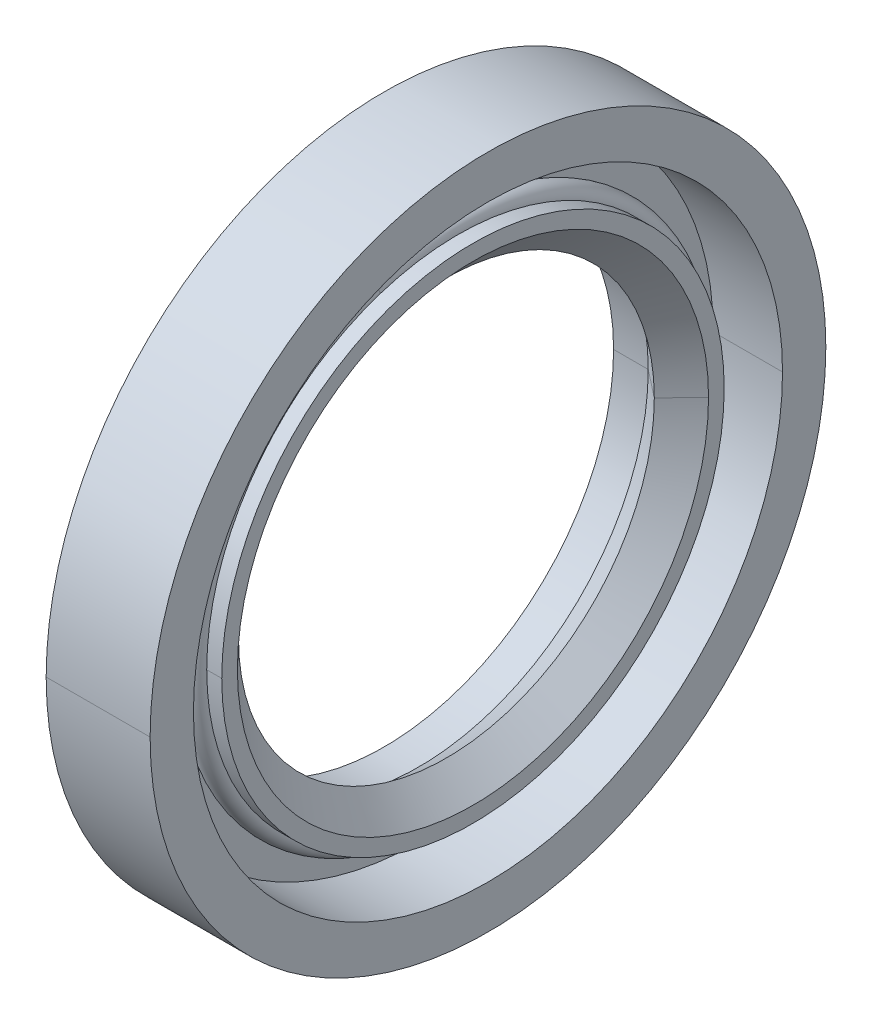
ISO-10303-21;
HEADER;
FILE_DESCRIPTION(('STEP AP214'),'2;1');
FILE_NAME('part.step','',(''),(''),'','','');
FILE_SCHEMA(('AUTOMOTIVE_DESIGN { 1 0 10303 214 1 1 1 1 }'));
ENDSEC;
DATA;
#1=APPLICATION_CONTEXT('core data for automotive mechanical design processes');
#2=APPLICATION_PROTOCOL_DEFINITION('international standard','automotive_design',2000,#1);
#3=PRODUCT_CONTEXT('',#1,'mechanical');
#4=PRODUCT('Part','Part','',(#3));
#5=PRODUCT_RELATED_PRODUCT_CATEGORY('part','',(#4));
#6=PRODUCT_DEFINITION_FORMATION('','',#4);
#7=PRODUCT_DEFINITION_CONTEXT('part definition',#1,'design');
#8=PRODUCT_DEFINITION('design','',#6,#7);
#9=PRODUCT_DEFINITION_SHAPE('','',#8);
#10=(LENGTH_UNIT() NAMED_UNIT(*) SI_UNIT(.MILLI.,.METRE.));
#11=(NAMED_UNIT(*) PLANE_ANGLE_UNIT() SI_UNIT($,.RADIAN.));
#12=(NAMED_UNIT(*) SI_UNIT($,.STERADIAN.) SOLID_ANGLE_UNIT());
#13=UNCERTAINTY_MEASURE_WITH_UNIT(LENGTH_MEASURE(1.E-05),#10,'distance_accuracy_value','');
#14=(GEOMETRIC_REPRESENTATION_CONTEXT(3) GLOBAL_UNCERTAINTY_ASSIGNED_CONTEXT((#13)) GLOBAL_UNIT_ASSIGNED_CONTEXT((#10,
#11,#12)) REPRESENTATION_CONTEXT('',''));
#15=CARTESIAN_POINT('',(0.,0.,0.));
#16=DIRECTION('',(0.,0.,1.));
#17=DIRECTION('',(1.,0.,0.));
#18=AXIS2_PLACEMENT_3D('',#15,#16,#17);
#19=CARTESIAN_POINT('',(10.,0.,0.));
#20=DIRECTION('',(1.,0.,0.));
#21=DIRECTION('',(0.,1.,0.));
#22=AXIS2_PLACEMENT_3D('',#19,#20,#21);
#23=CYLINDRICAL_SURFACE('',#22,32.5);
#24=DIRECTION('',(1.,0.,0.));
#25=VECTOR('',#24,1.);
#26=CARTESIAN_POINT('',(0.,0.,32.5));
#27=LINE('',#26,#25);
#28=CARTESIAN_POINT('',(0.,0.,32.5));
#29=VERTEX_POINT('',#28);
#30=CARTESIAN_POINT('',(10.,0.,32.5));
#31=VERTEX_POINT('',#30);
#32=EDGE_CURVE('E11',#29,#31,#27,.T.);
#33=ORIENTED_EDGE('',*,*,#32,.F.);
#34=CARTESIAN_POINT('',(0.,0.,0.));
#35=DIRECTION('',(1.,0.,0.));
#36=DIRECTION('',(0.,0.,-1.));
#37=AXIS2_PLACEMENT_3D('',#34,#35,#36);
#38=CIRCLE('',#37,32.5);
#39=CARTESIAN_POINT('',(0.,0.,-32.5));
#40=VERTEX_POINT('',#39);
#41=EDGE_CURVE('E25',#29,#40,#38,.T.);
#42=ORIENTED_EDGE('',*,*,#41,.T.);
#43=DIRECTION('',(1.,0.,0.));
#44=VECTOR('',#43,1.);
#45=CARTESIAN_POINT('',(0.,0.,-32.5));
#46=LINE('',#45,#44);
#47=CARTESIAN_POINT('',(10.,0.,-32.5));
#48=VERTEX_POINT('',#47);
#49=EDGE_CURVE('E320',#40,#48,#46,.T.);
#50=ORIENTED_EDGE('',*,*,#49,.T.);
#51=CARTESIAN_POINT('',(10.,0.,0.));
#52=DIRECTION('',(1.,0.,0.));
#53=DIRECTION('',(0.,0.,-1.));
#54=AXIS2_PLACEMENT_3D('',#51,#52,#53);
#55=CIRCLE('',#54,32.5);
#56=EDGE_CURVE('E315',#31,#48,#55,.T.);
#57=ORIENTED_EDGE('',*,*,#56,.F.);
#58=EDGE_LOOP('',(#33,#42,#50,#57));
#59=FACE_BOUND('',#58,.T.);
#60=ADVANCED_FACE('F17',(#59),#23,.T.);
#61=CARTESIAN_POINT('',(10.,28.333333333333,0.));
#62=DIRECTION('',(1.,0.,0.));
#63=DIRECTION('',(0.,0.,-1.));
#64=AXIS2_PLACEMENT_3D('',#61,#62,#63);
#65=PLANE('',#64);
#66=CARTESIAN_POINT('',(10.,0.,0.));
#67=DIRECTION('',(1.,0.,0.));
#68=DIRECTION('',(0.,0.,-1.));
#69=AXIS2_PLACEMENT_3D('',#66,#67,#68);
#70=CIRCLE('',#69,32.5);
#71=EDGE_CURVE('E310',#48,#31,#70,.T.);
#72=ORIENTED_EDGE('',*,*,#71,.T.);
#73=ORIENTED_EDGE('',*,*,#56,.T.);
#74=EDGE_LOOP('',(#72,#73));
#75=FACE_BOUND('',#74,.T.);
#76=CARTESIAN_POINT('',(10.,0.,0.));
#77=DIRECTION('',(1.,0.,0.));
#78=DIRECTION('',(0.,0.,-1.));
#79=AXIS2_PLACEMENT_3D('',#76,#77,#78);
#80=CIRCLE('',#79,28.333333333333);
#81=CARTESIAN_POINT('',(10.,0.,28.333333333333));
#82=VERTEX_POINT('',#81);
#83=CARTESIAN_POINT('',(10.,0.,-28.333333333333));
#84=VERTEX_POINT('',#83);
#85=EDGE_CURVE('E305',#82,#84,#80,.T.);
#86=ORIENTED_EDGE('',*,*,#85,.F.);
#87=CARTESIAN_POINT('',(10.,0.,0.));
#88=DIRECTION('',(1.,0.,0.));
#89=DIRECTION('',(0.,0.,-1.));
#90=AXIS2_PLACEMENT_3D('',#87,#88,#89);
#91=CIRCLE('',#90,28.333333333333);
#92=EDGE_CURVE('E300',#84,#82,#91,.T.);
#93=ORIENTED_EDGE('',*,*,#92,.F.);
#94=EDGE_LOOP('',(#86,#93));
#95=FACE_BOUND('',#94,.T.);
#96=ADVANCED_FACE('F333',(#75,#95),#65,.T.);
#97=CARTESIAN_POINT('',(10.,0.,0.));
#98=DIRECTION('',(1.,0.,0.));
#99=DIRECTION('',(0.,-1.,0.));
#100=AXIS2_PLACEMENT_3D('',#97,#98,#99);
#101=CYLINDRICAL_SURFACE('',#100,28.333333333333);
#102=DIRECTION('',(1.,0.,0.));
#103=VECTOR('',#102,1.);
#104=CARTESIAN_POINT('',(3.3333333333333,0.,28.333333333333));
#105=LINE('',#104,#103);
#106=CARTESIAN_POINT('',(3.3333333333333,0.,28.333333333333));
#107=VERTEX_POINT('',#106);
#108=EDGE_CURVE('E295',#107,#82,#105,.T.);
#109=ORIENTED_EDGE('',*,*,#108,.F.);
#110=CARTESIAN_POINT('',(3.3333333333333,0.,0.));
#111=DIRECTION('',(1.,0.,0.));
#112=DIRECTION('',(0.,0.,-1.));
#113=AXIS2_PLACEMENT_3D('',#110,#111,#112);
#114=CIRCLE('',#113,28.333333333333);
#115=CARTESIAN_POINT('',(3.3333333333333,0.,-28.333333333333));
#116=VERTEX_POINT('',#115);
#117=EDGE_CURVE('E290',#116,#107,#114,.T.);
#118=ORIENTED_EDGE('',*,*,#117,.F.);
#119=DIRECTION('',(1.,0.,0.));
#120=VECTOR('',#119,1.);
#121=CARTESIAN_POINT('',(3.3333333333333,0.,-28.333333333333));
#122=LINE('',#121,#120);
#123=EDGE_CURVE('E285',#116,#84,#122,.T.);
#124=ORIENTED_EDGE('',*,*,#123,.T.);
#125=ORIENTED_EDGE('',*,*,#92,.T.);
#126=EDGE_LOOP('',(#109,#118,#124,#125));
#127=FACE_BOUND('',#126,.T.);
#128=ADVANCED_FACE('F336',(#127),#101,.F.);
#129=CARTESIAN_POINT('',(10.,0.,0.));
#130=DIRECTION('',(1.,0.,0.));
#131=DIRECTION('',(0.,1.,0.));
#132=AXIS2_PLACEMENT_3D('',#129,#130,#131);
#133=CYLINDRICAL_SURFACE('',#132,28.333333333333);
#134=ORIENTED_EDGE('',*,*,#108,.T.);
#135=ORIENTED_EDGE('',*,*,#85,.T.);
#136=ORIENTED_EDGE('',*,*,#123,.F.);
#137=CARTESIAN_POINT('',(3.3333333333333,0.,0.));
#138=DIRECTION('',(1.,0.,0.));
#139=DIRECTION('',(0.,0.,-1.));
#140=AXIS2_PLACEMENT_3D('',#137,#138,#139);
#141=CIRCLE('',#140,28.333333333333);
#142=EDGE_CURVE('E280',#107,#116,#141,.T.);
#143=ORIENTED_EDGE('',*,*,#142,.F.);
#144=EDGE_LOOP('',(#134,#135,#136,#143));
#145=FACE_BOUND('',#144,.T.);
#146=ADVANCED_FACE('F340',(#145),#133,.F.);
#147=CARTESIAN_POINT('',(3.3333333333333,24.166666666667,0.));
#148=DIRECTION('',(1.,0.,0.));
#149=DIRECTION('',(0.,0.,-1.));
#150=AXIS2_PLACEMENT_3D('',#147,#148,#149);
#151=PLANE('',#150);
#152=ORIENTED_EDGE('',*,*,#117,.T.);
#153=ORIENTED_EDGE('',*,*,#142,.T.);
#154=EDGE_LOOP('',(#152,#153));
#155=FACE_BOUND('',#154,.T.);
#156=CARTESIAN_POINT('',(3.3333333333333,0.,0.));
#157=DIRECTION('',(1.,0.,0.));
#158=DIRECTION('',(0.,0.,-1.));
#159=AXIS2_PLACEMENT_3D('',#156,#157,#158);
#160=CIRCLE('',#159,24.166666666667);
#161=CARTESIAN_POINT('',(3.3333333333333,0.,24.166666666667));
#162=VERTEX_POINT('',#161);
#163=CARTESIAN_POINT('',(3.3333333333333,0.,-24.166666666667));
#164=VERTEX_POINT('',#163);
#165=EDGE_CURVE('E275',#162,#164,#160,.T.);
#166=ORIENTED_EDGE('',*,*,#165,.F.);
#167=CARTESIAN_POINT('',(3.3333333333333,0.,0.));
#168=DIRECTION('',(1.,0.,0.));
#169=DIRECTION('',(0.,0.,-1.));
#170=AXIS2_PLACEMENT_3D('',#167,#168,#169);
#171=CIRCLE('',#170,24.166666666667);
#172=EDGE_CURVE('E270',#164,#162,#171,.T.);
#173=ORIENTED_EDGE('',*,*,#172,.F.);
#174=EDGE_LOOP('',(#166,#173));
#175=FACE_BOUND('',#174,.T.);
#176=ADVANCED_FACE('F343',(#155,#175),#151,.T.);
#177=CARTESIAN_POINT('',(10.,0.,0.));
#178=DIRECTION('',(1.,0.,0.));
#179=DIRECTION('',(0.,-1.,0.));
#180=AXIS2_PLACEMENT_3D('',#177,#178,#179);
#181=CYLINDRICAL_SURFACE('',#180,24.166666666667);
#182=DIRECTION('',(1.,0.,0.));
#183=VECTOR('',#182,1.);
#184=CARTESIAN_POINT('',(3.3333333333333,0.,24.166666666667));
#185=LINE('',#184,#183);
#186=CARTESIAN_POINT('',(4.888889,0.,24.166666666667));
#187=VERTEX_POINT('',#186);
#188=EDGE_CURVE('E266',#162,#187,#185,.T.);
#189=ORIENTED_EDGE('',*,*,#188,.T.);
#190=CARTESIAN_POINT('',(4.888889,0.,0.));
#191=DIRECTION('',(1.,0.,0.));
#192=DIRECTION('',(0.,0.,-1.));
#193=AXIS2_PLACEMENT_3D('',#190,#191,#192);
#194=CIRCLE('',#193,24.166666666667);
#195=CARTESIAN_POINT('',(4.888889,22.9838658104665,7.46791069739466));
#196=VERTEX_POINT('',#195);
#197=EDGE_CURVE('E261',#196,#187,#194,.T.);
#198=ORIENTED_EDGE('',*,*,#197,.F.);
#199=CARTESIAN_POINT('',(4.888889,0.,0.));
#200=DIRECTION('',(1.,0.,0.));
#201=DIRECTION('',(0.,0.,-1.));
#202=AXIS2_PLACEMENT_3D('',#199,#200,#201);
#203=CIRCLE('',#202,24.166666666667);
#204=CARTESIAN_POINT('',(4.888889,0.,-24.166666666667));
#205=VERTEX_POINT('',#204);
#206=EDGE_CURVE('E256',#205,#196,#203,.T.);
#207=ORIENTED_EDGE('',*,*,#206,.F.);
#208=DIRECTION('',(1.,0.,0.));
#209=VECTOR('',#208,1.);
#210=CARTESIAN_POINT('',(3.3333333333333,0.,-24.166666666667));
#211=LINE('',#210,#209);
#212=EDGE_CURVE('E251',#164,#205,#211,.T.);
#213=ORIENTED_EDGE('',*,*,#212,.F.);
#214=ORIENTED_EDGE('',*,*,#172,.T.);
#215=EDGE_LOOP('',(#189,#198,#207,#213,#214));
#216=FACE_BOUND('',#215,.T.);
#217=ADVANCED_FACE('F346',(#216),#181,.T.);
#218=CARTESIAN_POINT('',(10.,0.,0.));
#219=DIRECTION('',(1.,0.,0.));
#220=DIRECTION('',(0.,1.,0.));
#221=AXIS2_PLACEMENT_3D('',#218,#219,#220);
#222=CYLINDRICAL_SURFACE('',#221,24.166666666667);
#223=ORIENTED_EDGE('',*,*,#188,.F.);
#224=ORIENTED_EDGE('',*,*,#165,.T.);
#225=ORIENTED_EDGE('',*,*,#212,.T.);
#226=CARTESIAN_POINT('',(4.888889,0.,0.));
#227=DIRECTION('',(1.,0.,0.));
#228=DIRECTION('',(0.,0.,-1.));
#229=AXIS2_PLACEMENT_3D('',#226,#227,#228);
#230=CIRCLE('',#229,24.166666666667);
#231=CARTESIAN_POINT('',(4.888889,-22.9838658104665,-7.46791069739466));
#232=VERTEX_POINT('',#231);
#233=EDGE_CURVE('E246',#232,#205,#230,.T.);
#234=ORIENTED_EDGE('',*,*,#233,.F.);
#235=CARTESIAN_POINT('',(4.888889,0.,0.));
#236=DIRECTION('',(1.,0.,0.));
#237=DIRECTION('',(0.,0.,-1.));
#238=AXIS2_PLACEMENT_3D('',#235,#236,#237);
#239=CIRCLE('',#238,24.166666666667);
#240=EDGE_CURVE('E241',#187,#232,#239,.T.);
#241=ORIENTED_EDGE('',*,*,#240,.F.);
#242=EDGE_LOOP('',(#223,#224,#225,#234,#241));
#243=FACE_BOUND('',#242,.T.);
#244=ADVANCED_FACE('F352',(#243),#222,.T.);
#245=CARTESIAN_POINT('',(6.,0.,0.));
#246=DIRECTION('',(1.,0.,0.));
#247=DIRECTION('',(0.,0.309016994374947,-0.951056516295154));
#248=AXIS2_PLACEMENT_3D('',#245,#246,#247);
#249=TOROIDAL_SURFACE('',#248,24.166666666667,1.111111);
#250=CARTESIAN_POINT('',(6.,-22.9838658104665,-7.46791069739466));
#251=DIRECTION('',(0.,0.309016994374947,-0.951056516295154));
#252=DIRECTION('',(1.,0.,0.));
#253=AXIS2_PLACEMENT_3D('',#250,#251,#252);
#254=CIRCLE('',#253,1.111111);
#255=CARTESIAN_POINT('',(7.111111,-22.9838658104665,-7.46791069739466));
#256=VERTEX_POINT('',#255);
#257=EDGE_CURVE('E236',#256,#232,#254,.T.);
#258=ORIENTED_EDGE('',*,*,#257,.F.);
#259=CARTESIAN_POINT('',(7.111111,0.,0.));
#260=DIRECTION('',(1.,0.,0.));
#261=DIRECTION('',(0.,0.,-1.));
#262=AXIS2_PLACEMENT_3D('',#259,#260,#261);
#263=CIRCLE('',#262,24.166666666667);
#264=CARTESIAN_POINT('',(7.111111,0.,24.166666666667));
#265=VERTEX_POINT('',#264);
#266=EDGE_CURVE('E231',#265,#256,#263,.T.);
#267=ORIENTED_EDGE('',*,*,#266,.F.);
#268=CARTESIAN_POINT('',(7.111111,0.,0.));
#269=DIRECTION('',(1.,0.,0.));
#270=DIRECTION('',(0.,0.,-1.));
#271=AXIS2_PLACEMENT_3D('',#268,#269,#270);
#272=CIRCLE('',#271,24.166666666667);
#273=CARTESIAN_POINT('',(7.111111,22.9838658104665,7.46791069739466));
#274=VERTEX_POINT('',#273);
#275=EDGE_CURVE('E226',#274,#265,#272,.T.);
#276=ORIENTED_EDGE('',*,*,#275,.F.);
#277=CARTESIAN_POINT('',(6.,22.9838658104665,7.46791069739466));
#278=DIRECTION('',(0.,-0.309016994374947,0.951056516295154));
#279=DIRECTION('',(1.,0.,0.));
#280=AXIS2_PLACEMENT_3D('',#277,#278,#279);
#281=CIRCLE('',#280,1.111111);
#282=EDGE_CURVE('E221',#274,#196,#281,.T.);
#283=ORIENTED_EDGE('',*,*,#282,.T.);
#284=ORIENTED_EDGE('',*,*,#197,.T.);
#285=ORIENTED_EDGE('',*,*,#240,.T.);
#286=EDGE_LOOP('',(#258,#267,#276,#283,#284,#285));
#287=FACE_BOUND('',#286,.T.);
#288=ADVANCED_FACE('F359',(#287),#249,.T.);
#289=CARTESIAN_POINT('',(6.,0.,0.));
#290=DIRECTION('',(1.,0.,0.));
#291=DIRECTION('',(0.,-0.309016994374947,0.951056516295154));
#292=AXIS2_PLACEMENT_3D('',#289,#290,#291);
#293=TOROIDAL_SURFACE('',#292,24.166666666667,1.111111);
#294=ORIENTED_EDGE('',*,*,#257,.T.);
#295=ORIENTED_EDGE('',*,*,#233,.T.);
#296=ORIENTED_EDGE('',*,*,#206,.T.);
#297=ORIENTED_EDGE('',*,*,#282,.F.);
#298=CARTESIAN_POINT('',(7.111111,0.,0.));
#299=DIRECTION('',(1.,0.,0.));
#300=DIRECTION('',(0.,0.,-1.));
#301=AXIS2_PLACEMENT_3D('',#298,#299,#300);
#302=CIRCLE('',#301,24.166666666667);
#303=CARTESIAN_POINT('',(7.111111,0.,-24.166666666667));
#304=VERTEX_POINT('',#303);
#305=EDGE_CURVE('E216',#304,#274,#302,.T.);
#306=ORIENTED_EDGE('',*,*,#305,.F.);
#307=CARTESIAN_POINT('',(7.111111,0.,0.));
#308=DIRECTION('',(1.,0.,0.));
#309=DIRECTION('',(0.,0.,-1.));
#310=AXIS2_PLACEMENT_3D('',#307,#308,#309);
#311=CIRCLE('',#310,24.166666666667);
#312=EDGE_CURVE('E211',#256,#304,#311,.T.);
#313=ORIENTED_EDGE('',*,*,#312,.F.);
#314=EDGE_LOOP('',(#294,#295,#296,#297,#306,#313));
#315=FACE_BOUND('',#314,.T.);
#316=ADVANCED_FACE('F355',(#315),#293,.T.);
#317=CARTESIAN_POINT('',(10.,0.,0.));
#318=DIRECTION('',(1.,0.,0.));
#319=DIRECTION('',(0.,1.,0.));
#320=AXIS2_PLACEMENT_3D('',#317,#318,#319);
#321=CYLINDRICAL_SURFACE('',#320,24.166666666667);
#322=DIRECTION('',(1.,0.,0.));
#323=VECTOR('',#322,1.);
#324=CARTESIAN_POINT('',(7.111111,0.,24.166666666667));
#325=LINE('',#324,#323);
#326=CARTESIAN_POINT('',(8.5555555,0.,24.166666666667));
#327=VERTEX_POINT('',#326);
#328=EDGE_CURVE('E206',#265,#327,#325,.T.);
#329=ORIENTED_EDGE('',*,*,#328,.F.);
#330=ORIENTED_EDGE('',*,*,#266,.T.);
#331=ORIENTED_EDGE('',*,*,#312,.T.);
#332=DIRECTION('',(1.,0.,0.));
#333=VECTOR('',#332,1.);
#334=CARTESIAN_POINT('',(7.111111,0.,-24.166666666667));
#335=LINE('',#334,#333);
#336=CARTESIAN_POINT('',(8.5555555,0.,-24.166666666667));
#337=VERTEX_POINT('',#336);
#338=EDGE_CURVE('E202',#304,#337,#335,.T.);
#339=ORIENTED_EDGE('',*,*,#338,.T.);
#340=CARTESIAN_POINT('',(8.5555555,0.,0.));
#341=DIRECTION('',(1.,0.,0.));
#342=DIRECTION('',(0.,0.,-1.));
#343=AXIS2_PLACEMENT_3D('',#340,#341,#342);
#344=CIRCLE('',#343,24.166666666667);
#345=EDGE_CURVE('E197',#327,#337,#344,.T.);
#346=ORIENTED_EDGE('',*,*,#345,.F.);
#347=EDGE_LOOP('',(#329,#330,#331,#339,#346));
#348=FACE_BOUND('',#347,.T.);
#349=ADVANCED_FACE('F364',(#348),#321,.T.);
#350=CARTESIAN_POINT('',(8.5555555,22.662036979167,0.));
#351=DIRECTION('',(1.,0.,0.));
#352=DIRECTION('',(0.,0.,-1.));
#353=AXIS2_PLACEMENT_3D('',#350,#351,#352);
#354=PLANE('',#353);
#355=CARTESIAN_POINT('',(8.5555555,0.,0.));
#356=DIRECTION('',(1.,0.,0.));
#357=DIRECTION('',(0.,0.,-1.));
#358=AXIS2_PLACEMENT_3D('',#355,#356,#357);
#359=CIRCLE('',#358,24.166666666667);
#360=EDGE_CURVE('E192',#337,#327,#359,.T.);
#361=ORIENTED_EDGE('',*,*,#360,.T.);
#362=ORIENTED_EDGE('',*,*,#345,.T.);
#363=EDGE_LOOP('',(#361,#362));
#364=FACE_BOUND('',#363,.T.);
#365=CARTESIAN_POINT('',(8.5555555,0.,0.));
#366=DIRECTION('',(1.,0.,0.));
#367=DIRECTION('',(0.,0.,-1.));
#368=AXIS2_PLACEMENT_3D('',#365,#366,#367);
#369=CIRCLE('',#368,22.662036979167);
#370=CARTESIAN_POINT('',(8.5555555,0.,22.662036979167));
#371=VERTEX_POINT('',#370);
#372=CARTESIAN_POINT('',(8.5555555,0.,-22.662036979167));
#373=VERTEX_POINT('',#372);
#374=EDGE_CURVE('E187',#371,#373,#369,.T.);
#375=ORIENTED_EDGE('',*,*,#374,.F.);
#376=CARTESIAN_POINT('',(8.5555555,0.,0.));
#377=DIRECTION('',(1.,0.,0.));
#378=DIRECTION('',(0.,0.,-1.));
#379=AXIS2_PLACEMENT_3D('',#376,#377,#378);
#380=CIRCLE('',#379,22.662036979167);
#381=EDGE_CURVE('E182',#373,#371,#380,.T.);
#382=ORIENTED_EDGE('',*,*,#381,.F.);
#383=EDGE_LOOP('',(#375,#382));
#384=FACE_BOUND('',#383,.T.);
#385=ADVANCED_FACE('F368',(#364,#384),#354,.T.);
#386=CARTESIAN_POINT('',(6.,0.,0.));
#387=DIRECTION('',(1.,0.,0.));
#388=DIRECTION('',(0.,-1.,0.));
#389=AXIS2_PLACEMENT_3D('',#386,#387,#388);
#390=CONICAL_SURFACE('',#389,20.,0.805803494084048);
#391=DIRECTION('',(0.692531828189669,0.,0.721387321030994));
#392=VECTOR('',#391,1.);
#393=CARTESIAN_POINT('',(6.,0.,20.));
#394=LINE('',#393,#392);
#395=CARTESIAN_POINT('',(6.,0.,20.));
#396=VERTEX_POINT('',#395);
#397=EDGE_CURVE('E177',#396,#371,#394,.T.);
#398=ORIENTED_EDGE('',*,*,#397,.F.);
#399=CARTESIAN_POINT('',(6.,0.,0.));
#400=DIRECTION('',(1.,0.,0.));
#401=DIRECTION('',(0.,0.,-1.));
#402=AXIS2_PLACEMENT_3D('',#399,#400,#401);
#403=CIRCLE('',#402,20.);
#404=CARTESIAN_POINT('',(6.,0.,-20.));
#405=VERTEX_POINT('',#404);
#406=EDGE_CURVE('E172',#405,#396,#403,.T.);
#407=ORIENTED_EDGE('',*,*,#406,.F.);
#408=DIRECTION('',(0.692531828189669,0.,-0.721387321030994));
#409=VECTOR('',#408,1.);
#410=CARTESIAN_POINT('',(6.,0.,-20.));
#411=LINE('',#410,#409);
#412=EDGE_CURVE('E167',#405,#373,#411,.T.);
#413=ORIENTED_EDGE('',*,*,#412,.T.);
#414=ORIENTED_EDGE('',*,*,#381,.T.);
#415=EDGE_LOOP('',(#398,#407,#413,#414));
#416=FACE_BOUND('',#415,.T.);
#417=ADVANCED_FACE('F371',(#416),#390,.F.);
#418=CARTESIAN_POINT('',(6.,0.,0.));
#419=DIRECTION('',(1.,0.,0.));
#420=DIRECTION('',(0.,1.,0.));
#421=AXIS2_PLACEMENT_3D('',#418,#419,#420);
#422=CONICAL_SURFACE('',#421,20.,0.805803494084048);
#423=ORIENTED_EDGE('',*,*,#397,.T.);
#424=ORIENTED_EDGE('',*,*,#374,.T.);
#425=ORIENTED_EDGE('',*,*,#412,.F.);
#426=CARTESIAN_POINT('',(6.,0.,0.));
#427=DIRECTION('',(1.,0.,0.));
#428=DIRECTION('',(0.,0.,-1.));
#429=AXIS2_PLACEMENT_3D('',#426,#427,#428);
#430=CIRCLE('',#429,20.);
#431=EDGE_CURVE('E162',#396,#405,#430,.T.);
#432=ORIENTED_EDGE('',*,*,#431,.F.);
#433=EDGE_LOOP('',(#423,#424,#425,#432));
#434=FACE_BOUND('',#433,.T.);
#435=ADVANCED_FACE('F376',(#434),#422,.F.);
#436=CARTESIAN_POINT('',(3.3333333333333,0.,0.));
#437=DIRECTION('',(-1.,0.,0.));
#438=DIRECTION('',(0.,1.,0.));
#439=AXIS2_PLACEMENT_3D('',#436,#437,#438);
#440=CONICAL_SURFACE('',#439,22.083333333333,0.663202992706011);
#441=DIRECTION('',(-0.788024373724614,0.,-0.61564404197225));
#442=VECTOR('',#441,1.);
#443=CARTESIAN_POINT('',(6.,0.,-20.));
#444=LINE('',#443,#442);
#445=CARTESIAN_POINT('',(3.3333333333333,0.,-22.083333333333));
#446=VERTEX_POINT('',#445);
#447=EDGE_CURVE('E158',#405,#446,#444,.T.);
#448=ORIENTED_EDGE('',*,*,#447,.T.);
#449=CARTESIAN_POINT('',(3.3333333333333,0.,0.));
#450=DIRECTION('',(1.,0.,0.));
#451=DIRECTION('',(0.,0.,-1.));
#452=AXIS2_PLACEMENT_3D('',#449,#450,#451);
#453=CIRCLE('',#452,22.083333333333);
#454=CARTESIAN_POINT('',(3.3333333333333,0.,22.083333333333));
#455=VERTEX_POINT('',#454);
#456=EDGE_CURVE('E129',#455,#446,#453,.T.);
#457=ORIENTED_EDGE('',*,*,#456,.F.);
#458=DIRECTION('',(-0.788024373724614,0.,0.61564404197225));
#459=VECTOR('',#458,1.);
#460=CARTESIAN_POINT('',(6.,0.,20.));
#461=LINE('',#460,#459);
#462=EDGE_CURVE('E150',#396,#455,#461,.T.);
#463=ORIENTED_EDGE('',*,*,#462,.F.);
#464=ORIENTED_EDGE('',*,*,#431,.T.);
#465=EDGE_LOOP('',(#448,#457,#463,#464));
#466=FACE_BOUND('',#465,.T.);
#467=ADVANCED_FACE('F381',(#466),#440,.F.);
#468=CARTESIAN_POINT('',(3.3333333333333,0.,0.));
#469=DIRECTION('',(-1.,0.,0.));
#470=DIRECTION('',(0.,-1.,0.));
#471=AXIS2_PLACEMENT_3D('',#468,#469,#470);
#472=CONICAL_SURFACE('',#471,22.083333333333,0.663202992706011);
#473=ORIENTED_EDGE('',*,*,#447,.F.);
#474=ORIENTED_EDGE('',*,*,#406,.T.);
#475=ORIENTED_EDGE('',*,*,#462,.T.);
#476=CARTESIAN_POINT('',(3.3333333333333,0.,0.));
#477=DIRECTION('',(1.,0.,0.));
#478=DIRECTION('',(0.,0.,-1.));
#479=AXIS2_PLACEMENT_3D('',#476,#477,#478);
#480=CIRCLE('',#479,22.083333333333);
#481=EDGE_CURVE('E146',#446,#455,#480,.T.);
#482=ORIENTED_EDGE('',*,*,#481,.F.);
#483=EDGE_LOOP('',(#473,#474,#475,#482));
#484=FACE_BOUND('',#483,.T.);
#485=ADVANCED_FACE('F384',(#484),#472,.F.);
#486=CARTESIAN_POINT('',(10.,0.,0.));
#487=DIRECTION('',(1.,0.,0.));
#488=DIRECTION('',(0.,-1.,0.));
#489=AXIS2_PLACEMENT_3D('',#486,#487,#488);
#490=CYLINDRICAL_SURFACE('',#489,22.083333333333);
#491=DIRECTION('',(1.,0.,0.));
#492=VECTOR('',#491,1.);
#493=CARTESIAN_POINT('',(0.,0.,22.083333333333));
#494=LINE('',#493,#492);
#495=CARTESIAN_POINT('',(0.,0.,22.083333333333));
#496=VERTEX_POINT('',#495);
#497=EDGE_CURVE('E121',#496,#455,#494,.T.);
#498=ORIENTED_EDGE('',*,*,#497,.F.);
#499=CARTESIAN_POINT('',(0.,0.,0.));
#500=DIRECTION('',(1.,0.,0.));
#501=DIRECTION('',(0.,0.,-1.));
#502=AXIS2_PLACEMENT_3D('',#499,#500,#501);
#503=CIRCLE('',#502,22.083333333333);
#504=CARTESIAN_POINT('',(0.,0.,-22.083333333333));
#505=VERTEX_POINT('',#504);
#506=EDGE_CURVE('E114',#505,#496,#503,.T.);
#507=ORIENTED_EDGE('',*,*,#506,.F.);
#508=DIRECTION('',(1.,0.,0.));
#509=VECTOR('',#508,1.);
#510=CARTESIAN_POINT('',(0.,0.,-22.083333333333));
#511=LINE('',#510,#509);
#512=EDGE_CURVE('E118',#505,#446,#511,.T.);
#513=ORIENTED_EDGE('',*,*,#512,.T.);
#514=ORIENTED_EDGE('',*,*,#481,.T.);
#515=EDGE_LOOP('',(#498,#507,#513,#514));
#516=FACE_BOUND('',#515,.T.);
#517=ADVANCED_FACE('F116',(#516),#490,.F.);
#518=CARTESIAN_POINT('',(10.,0.,0.));
#519=DIRECTION('',(1.,0.,0.));
#520=DIRECTION('',(0.,1.,0.));
#521=AXIS2_PLACEMENT_3D('',#518,#519,#520);
#522=CYLINDRICAL_SURFACE('',#521,22.083333333333);
#523=ORIENTED_EDGE('',*,*,#497,.T.);
#524=ORIENTED_EDGE('',*,*,#456,.T.);
#525=ORIENTED_EDGE('',*,*,#512,.F.);
#526=CARTESIAN_POINT('',(0.,0.,0.));
#527=DIRECTION('',(1.,0.,0.));
#528=DIRECTION('',(0.,0.,-1.));
#529=AXIS2_PLACEMENT_3D('',#526,#527,#528);
#530=CIRCLE('',#529,22.083333333333);
#531=EDGE_CURVE('E128',#496,#505,#530,.T.);
#532=ORIENTED_EDGE('',*,*,#531,.F.);
#533=EDGE_LOOP('',(#523,#524,#525,#532));
#534=FACE_BOUND('',#533,.T.);
#535=ADVANCED_FACE('F127',(#534),#522,.F.);
#536=CARTESIAN_POINT('',(0.,32.5,0.));
#537=DIRECTION('',(-1.,0.,0.));
#538=DIRECTION('',(0.,0.,1.));
#539=AXIS2_PLACEMENT_3D('',#536,#537,#538);
#540=PLANE('',#539);
#541=ORIENTED_EDGE('',*,*,#506,.T.);
#542=ORIENTED_EDGE('',*,*,#531,.T.);
#543=EDGE_LOOP('',(#541,#542));
#544=FACE_BOUND('',#543,.T.);
#545=ORIENTED_EDGE('',*,*,#41,.F.);
#546=CARTESIAN_POINT('',(0.,0.,0.));
#547=DIRECTION('',(1.,0.,0.));
#548=DIRECTION('',(0.,0.,-1.));
#549=AXIS2_PLACEMENT_3D('',#546,#547,#548);
#550=CIRCLE('',#549,32.5);
#551=EDGE_CURVE('E133',#40,#29,#550,.T.);
#552=ORIENTED_EDGE('',*,*,#551,.F.);
#553=EDGE_LOOP('',(#545,#552));
#554=FACE_BOUND('',#553,.T.);
#555=ADVANCED_FACE('F131',(#544,#554),#540,.T.);
#556=CARTESIAN_POINT('',(10.,0.,0.));
#557=DIRECTION('',(1.,0.,0.));
#558=DIRECTION('',(0.,-1.,0.));
#559=AXIS2_PLACEMENT_3D('',#556,#557,#558);
#560=CYLINDRICAL_SURFACE('',#559,32.5);
#561=ORIENTED_EDGE('',*,*,#32,.T.);
#562=ORIENTED_EDGE('',*,*,#71,.F.);
#563=ORIENTED_EDGE('',*,*,#49,.F.);
#564=ORIENTED_EDGE('',*,*,#551,.T.);
#565=EDGE_LOOP('',(#561,#562,#563,#564));
#566=FACE_BOUND('',#565,.T.);
#567=ADVANCED_FACE('F331',(#566),#560,.T.);
#568=CARTESIAN_POINT('',(10.,0.,0.));
#569=DIRECTION('',(1.,0.,0.));
#570=DIRECTION('',(0.,-1.,0.));
#571=AXIS2_PLACEMENT_3D('',#568,#569,#570);
#572=CYLINDRICAL_SURFACE('',#571,24.166666666667);
#573=ORIENTED_EDGE('',*,*,#328,.T.);
#574=ORIENTED_EDGE('',*,*,#360,.F.);
#575=ORIENTED_EDGE('',*,*,#338,.F.);
#576=ORIENTED_EDGE('',*,*,#305,.T.);
#577=ORIENTED_EDGE('',*,*,#275,.T.);
#578=EDGE_LOOP('',(#573,#574,#575,#576,#577));
#579=FACE_BOUND('',#578,.T.);
#580=ADVANCED_FACE('F366',(#579),#572,.T.);
#581=CLOSED_SHELL('',(#60,#96,#128,#146,#176,#217,#244,#288,#316,#349,#385,#417,#435,#467,#485,
#517,#535,#555,#567,#580));
#582=MANIFOLD_SOLID_BREP('B1',#581);
#583=ADVANCED_BREP_SHAPE_REPRESENTATION('',(#18,#582),#14);
#584=SHAPE_DEFINITION_REPRESENTATION(#9,#583);
ENDSEC;
END-ISO-10303-21;
